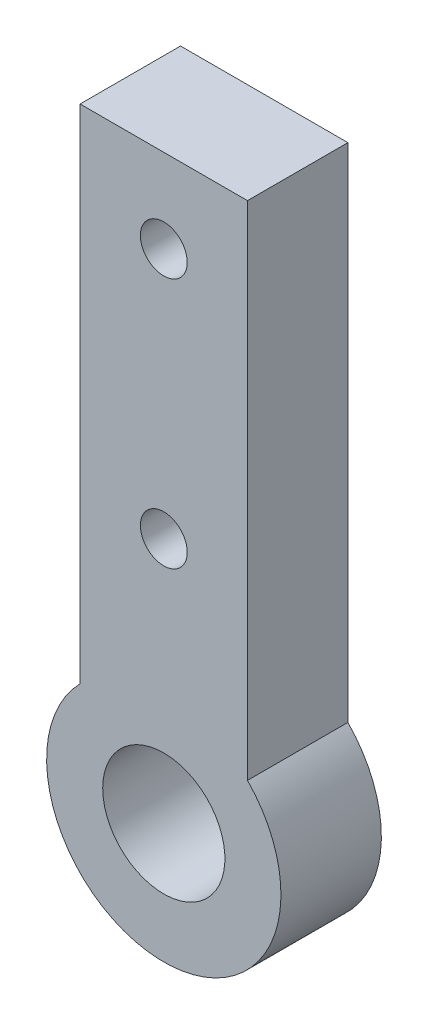
ISO-10303-21;
HEADER;
FILE_DESCRIPTION(('STEP AP214'),'2;1');
FILE_NAME('part.step','',(''),(''),'','','');
FILE_SCHEMA(('AUTOMOTIVE_DESIGN { 1 0 10303 214 1 1 1 1 }'));
ENDSEC;
DATA;
#1=APPLICATION_CONTEXT('core data for automotive mechanical design processes');
#2=APPLICATION_PROTOCOL_DEFINITION('international standard','automotive_design',2000,#1);
#3=PRODUCT_CONTEXT('',#1,'mechanical');
#4=PRODUCT('Part','Part','',(#3));
#5=PRODUCT_RELATED_PRODUCT_CATEGORY('part','',(#4));
#6=PRODUCT_DEFINITION_FORMATION('','',#4);
#7=PRODUCT_DEFINITION_CONTEXT('part definition',#1,'design');
#8=PRODUCT_DEFINITION('design','',#6,#7);
#9=PRODUCT_DEFINITION_SHAPE('','',#8);
#10=(LENGTH_UNIT() NAMED_UNIT(*) SI_UNIT(.MILLI.,.METRE.));
#11=(NAMED_UNIT(*) PLANE_ANGLE_UNIT() SI_UNIT($,.RADIAN.));
#12=(NAMED_UNIT(*) SI_UNIT($,.STERADIAN.) SOLID_ANGLE_UNIT());
#13=UNCERTAINTY_MEASURE_WITH_UNIT(LENGTH_MEASURE(1.E-05),#10,'distance_accuracy_value','');
#14=(GEOMETRIC_REPRESENTATION_CONTEXT(3) GLOBAL_UNCERTAINTY_ASSIGNED_CONTEXT((#13)) GLOBAL_UNIT_ASSIGNED_CONTEXT((#10,
#11,#12)) REPRESENTATION_CONTEXT('',''));
#15=CARTESIAN_POINT('',(0.,0.,0.));
#16=DIRECTION('',(0.,0.,1.));
#17=DIRECTION('',(1.,0.,0.));
#18=AXIS2_PLACEMENT_3D('',#15,#16,#17);
#19=CARTESIAN_POINT('',(-5.00000000000001,18.9279166419525,6.));
#20=DIRECTION('',(1.,0.,0.));
#21=DIRECTION('',(0.,1.,0.));
#22=AXIS2_PLACEMENT_3D('',#19,#20,#21);
#23=PLANE('',#22);
#24=DIRECTION('',(0.,-1.,0.));
#25=VECTOR('',#24,1.);
#26=CARTESIAN_POINT('',(-5.00000000000001,18.9279166419525,0.));
#27=LINE('',#26,#25);
#28=CARTESIAN_POINT('',(-5.00000000000001,18.9279166419525,0.));
#29=VERTEX_POINT('',#28);
#30=CARTESIAN_POINT('',(-5.00000000000001,-11.0720833580475,0.));
#31=VERTEX_POINT('',#30);
#32=EDGE_CURVE('E98',#29,#31,#27,.T.);
#33=ORIENTED_EDGE('',*,*,#32,.T.);
#34=DIRECTION('',(0.,0.,-1.));
#35=VECTOR('',#34,1.);
#36=CARTESIAN_POINT('',(-5.00000000000001,-11.0720833580475,6.));
#37=LINE('',#36,#35);
#38=CARTESIAN_POINT('',(-5.00000000000001,-11.0720833580475,6.));
#39=VERTEX_POINT('',#38);
#40=EDGE_CURVE('E11',#39,#31,#37,.T.);
#41=ORIENTED_EDGE('',*,*,#40,.F.);
#42=DIRECTION('',(0.,-1.,0.));
#43=VECTOR('',#42,1.);
#44=CARTESIAN_POINT('',(-5.00000000000001,18.9279166419525,6.));
#45=LINE('',#44,#43);
#46=CARTESIAN_POINT('',(-5.00000000000001,18.9279166419525,6.));
#47=VERTEX_POINT('',#46);
#48=EDGE_CURVE('E86',#47,#39,#45,.T.);
#49=ORIENTED_EDGE('',*,*,#48,.F.);
#50=DIRECTION('',(0.,0.,-1.));
#51=VECTOR('',#50,1.);
#52=CARTESIAN_POINT('',(-5.00000000000001,18.9279166419525,6.));
#53=LINE('',#52,#51);
#54=EDGE_CURVE('E94',#47,#29,#53,.T.);
#55=ORIENTED_EDGE('',*,*,#54,.T.);
#56=EDGE_LOOP('',(#33,#41,#49,#55));
#57=FACE_BOUND('',#56,.T.);
#58=ADVANCED_FACE('F35',(#57),#23,.F.);
#59=CARTESIAN_POINT('',(0.,-15.9710628436139,6.));
#60=DIRECTION('',(0.,0.,-1.));
#61=DIRECTION('',(-1.,0.,0.));
#62=AXIS2_PLACEMENT_3D('',#59,#60,#61);
#63=CYLINDRICAL_SURFACE('',#62,7.);
#64=CARTESIAN_POINT('',(0.,-15.9710628436139,0.));
#65=DIRECTION('',(0.,0.,1.));
#66=DIRECTION('',(-1.,0.,0.));
#67=AXIS2_PLACEMENT_3D('',#64,#65,#66);
#68=CIRCLE('',#67,7.);
#69=CARTESIAN_POINT('',(5.,-11.0720833580475,0.));
#70=VERTEX_POINT('',#69);
#71=EDGE_CURVE('E90',#31,#70,#68,.T.);
#72=ORIENTED_EDGE('',*,*,#71,.T.);
#73=DIRECTION('',(0.,0.,-1.));
#74=VECTOR('',#73,1.);
#75=CARTESIAN_POINT('',(5.,-11.0720833580475,6.));
#76=LINE('',#75,#74);
#77=CARTESIAN_POINT('',(5.,-11.0720833580475,6.));
#78=VERTEX_POINT('',#77);
#79=EDGE_CURVE('E43',#78,#70,#76,.T.);
#80=ORIENTED_EDGE('',*,*,#79,.F.);
#81=CARTESIAN_POINT('',(0.,-15.9710628436139,6.));
#82=DIRECTION('',(0.,0.,1.));
#83=DIRECTION('',(-1.,0.,0.));
#84=AXIS2_PLACEMENT_3D('',#81,#82,#83);
#85=CIRCLE('',#84,7.);
#86=EDGE_CURVE('E81',#39,#78,#85,.T.);
#87=ORIENTED_EDGE('',*,*,#86,.F.);
#88=ORIENTED_EDGE('',*,*,#40,.T.);
#89=EDGE_LOOP('',(#72,#80,#87,#88));
#90=FACE_BOUND('',#89,.T.);
#91=ADVANCED_FACE('F89',(#90),#63,.T.);
#92=CARTESIAN_POINT('',(4.99999999999999,18.9279166419525,6.));
#93=DIRECTION('',(-1.,0.,0.));
#94=DIRECTION('',(0.,-1.,0.));
#95=AXIS2_PLACEMENT_3D('',#92,#93,#94);
#96=PLANE('',#95);
#97=DIRECTION('',(0.,1.,0.));
#98=VECTOR('',#97,1.);
#99=CARTESIAN_POINT('',(4.99999999999999,18.9279166419525,0.));
#100=LINE('',#99,#98);
#101=CARTESIAN_POINT('',(4.99999999999999,18.9279166419525,0.));
#102=VERTEX_POINT('',#101);
#103=EDGE_CURVE('E68',#70,#102,#100,.T.);
#104=ORIENTED_EDGE('',*,*,#103,.T.);
#105=DIRECTION('',(0.,0.,-1.));
#106=VECTOR('',#105,1.);
#107=CARTESIAN_POINT('',(4.99999999999999,18.9279166419525,6.));
#108=LINE('',#107,#106);
#109=CARTESIAN_POINT('',(4.99999999999999,18.9279166419525,6.));
#110=VERTEX_POINT('',#109);
#111=EDGE_CURVE('E91',#110,#102,#108,.T.);
#112=ORIENTED_EDGE('',*,*,#111,.F.);
#113=DIRECTION('',(0.,1.,0.));
#114=VECTOR('',#113,1.);
#115=CARTESIAN_POINT('',(4.99999999999999,18.9279166419525,6.));
#116=LINE('',#115,#114);
#117=EDGE_CURVE('E84',#78,#110,#116,.T.);
#118=ORIENTED_EDGE('',*,*,#117,.F.);
#119=ORIENTED_EDGE('',*,*,#79,.T.);
#120=EDGE_LOOP('',(#104,#112,#118,#119));
#121=FACE_BOUND('',#120,.T.);
#122=ADVANCED_FACE('F92',(#121),#96,.F.);
#123=CARTESIAN_POINT('',(-5.00000000000001,18.9279166419525,6.));
#124=DIRECTION('',(0.,-1.,0.));
#125=DIRECTION('',(0.,0.,-1.));
#126=AXIS2_PLACEMENT_3D('',#123,#124,#125);
#127=PLANE('',#126);
#128=DIRECTION('',(-1.,0.,0.));
#129=VECTOR('',#128,1.);
#130=CARTESIAN_POINT('',(-5.00000000000001,18.9279166419525,0.));
#131=LINE('',#130,#129);
#132=EDGE_CURVE('E74',#102,#29,#131,.T.);
#133=ORIENTED_EDGE('',*,*,#132,.T.);
#134=ORIENTED_EDGE('',*,*,#54,.F.);
#135=DIRECTION('',(-1.,0.,0.));
#136=VECTOR('',#135,1.);
#137=CARTESIAN_POINT('',(-5.00000000000001,18.9279166419525,6.));
#138=LINE('',#137,#136);
#139=EDGE_CURVE('E51',#110,#47,#138,.T.);
#140=ORIENTED_EDGE('',*,*,#139,.F.);
#141=ORIENTED_EDGE('',*,*,#111,.T.);
#142=EDGE_LOOP('',(#133,#134,#140,#141));
#143=FACE_BOUND('',#142,.T.);
#144=ADVANCED_FACE('F106',(#143),#127,.F.);
#145=CARTESIAN_POINT('',(0.,-15.9710628436139,6.));
#146=DIRECTION('',(0.,0.,-1.));
#147=DIRECTION('',(-1.,0.,0.));
#148=AXIS2_PLACEMENT_3D('',#145,#146,#147);
#149=PLANE('',#148);
#150=CARTESIAN_POINT('',(0.,13.9279166419525,6.));
#151=DIRECTION('',(0.,0.,-1.));
#152=DIRECTION('',(-1.,0.,0.));
#153=AXIS2_PLACEMENT_3D('',#150,#151,#152);
#154=CIRCLE('',#153,1.4);
#155=CARTESIAN_POINT('',(-1.4,13.9279166419525,6.));
#156=VERTEX_POINT('',#155);
#157=EDGE_CURVE('E121',#156,#156,#154,.T.);
#158=ORIENTED_EDGE('',*,*,#157,.T.);
#159=EDGE_LOOP('',(#158));
#160=FACE_BOUND('',#159,.T.);
#161=CARTESIAN_POINT('',(0.,-1.07208335804753,6.));
#162=DIRECTION('',(0.,0.,-1.));
#163=DIRECTION('',(-1.,0.,0.));
#164=AXIS2_PLACEMENT_3D('',#161,#162,#163);
#165=CIRCLE('',#164,1.4);
#166=CARTESIAN_POINT('',(-1.4,-1.07208335804753,6.));
#167=VERTEX_POINT('',#166);
#168=EDGE_CURVE('E115',#167,#167,#165,.T.);
#169=ORIENTED_EDGE('',*,*,#168,.T.);
#170=EDGE_LOOP('',(#169));
#171=FACE_BOUND('',#170,.T.);
#172=CARTESIAN_POINT('',(0.,-15.7995866539924,6.));
#173=DIRECTION('',(0.,0.,-1.));
#174=DIRECTION('',(-1.,0.,0.));
#175=AXIS2_PLACEMENT_3D('',#172,#173,#174);
#176=CIRCLE('',#175,3.65);
#177=CARTESIAN_POINT('',(-3.65,-15.7995866539924,6.));
#178=VERTEX_POINT('',#177);
#179=EDGE_CURVE('E101',#178,#178,#176,.T.);
#180=ORIENTED_EDGE('',*,*,#179,.T.);
#181=EDGE_LOOP('',(#180));
#182=FACE_BOUND('',#181,.T.);
#183=ORIENTED_EDGE('',*,*,#48,.T.);
#184=ORIENTED_EDGE('',*,*,#86,.T.);
#185=ORIENTED_EDGE('',*,*,#117,.T.);
#186=ORIENTED_EDGE('',*,*,#139,.T.);
#187=EDGE_LOOP('',(#183,#184,#185,#186));
#188=FACE_BOUND('',#187,.T.);
#189=ADVANCED_FACE('F82',(#160,#171,#182,#188),#149,.F.);
#190=CARTESIAN_POINT('',(0.,-15.9710628436139,0.));
#191=DIRECTION('',(0.,0.,-1.));
#192=DIRECTION('',(-1.,0.,0.));
#193=AXIS2_PLACEMENT_3D('',#190,#191,#192);
#194=PLANE('',#193);
#195=CARTESIAN_POINT('',(0.,13.9279166419525,0.));
#196=DIRECTION('',(0.,0.,-1.));
#197=DIRECTION('',(-1.,0.,0.));
#198=AXIS2_PLACEMENT_3D('',#195,#196,#197);
#199=CIRCLE('',#198,1.4);
#200=CARTESIAN_POINT('',(-1.4,13.9279166419525,0.));
#201=VERTEX_POINT('',#200);
#202=EDGE_CURVE('E124',#201,#201,#199,.T.);
#203=ORIENTED_EDGE('',*,*,#202,.F.);
#204=EDGE_LOOP('',(#203));
#205=FACE_BOUND('',#204,.T.);
#206=CARTESIAN_POINT('',(0.,-1.07208335804753,0.));
#207=DIRECTION('',(0.,0.,-1.));
#208=DIRECTION('',(-1.,0.,0.));
#209=AXIS2_PLACEMENT_3D('',#206,#207,#208);
#210=CIRCLE('',#209,1.4);
#211=CARTESIAN_POINT('',(-1.4,-1.07208335804753,0.));
#212=VERTEX_POINT('',#211);
#213=EDGE_CURVE('E118',#212,#212,#210,.T.);
#214=ORIENTED_EDGE('',*,*,#213,.F.);
#215=EDGE_LOOP('',(#214));
#216=FACE_BOUND('',#215,.T.);
#217=CARTESIAN_POINT('',(0.,-15.7995866539924,0.));
#218=DIRECTION('',(0.,0.,-1.));
#219=DIRECTION('',(-1.,0.,0.));
#220=AXIS2_PLACEMENT_3D('',#217,#218,#219);
#221=CIRCLE('',#220,3.65);
#222=CARTESIAN_POINT('',(-3.65,-15.7995866539924,0.));
#223=VERTEX_POINT('',#222);
#224=EDGE_CURVE('E112',#223,#223,#221,.T.);
#225=ORIENTED_EDGE('',*,*,#224,.F.);
#226=EDGE_LOOP('',(#225));
#227=FACE_BOUND('',#226,.T.);
#228=ORIENTED_EDGE('',*,*,#32,.F.);
#229=ORIENTED_EDGE('',*,*,#132,.F.);
#230=ORIENTED_EDGE('',*,*,#103,.F.);
#231=ORIENTED_EDGE('',*,*,#71,.F.);
#232=EDGE_LOOP('',(#228,#229,#230,#231));
#233=FACE_BOUND('',#232,.T.);
#234=ADVANCED_FACE('F109',(#205,#216,#227,#233),#194,.T.);
#235=CARTESIAN_POINT('',(0.,-15.7995866539924,6.));
#236=DIRECTION('',(0.,0.,-1.));
#237=DIRECTION('',(-1.,0.,0.));
#238=AXIS2_PLACEMENT_3D('',#235,#236,#237);
#239=CYLINDRICAL_SURFACE('',#238,3.65);
#240=ORIENTED_EDGE('',*,*,#179,.F.);
#241=EDGE_LOOP('',(#240));
#242=FACE_BOUND('',#241,.T.);
#243=ORIENTED_EDGE('',*,*,#224,.T.);
#244=EDGE_LOOP('',(#243));
#245=FACE_BOUND('',#244,.T.);
#246=ADVANCED_FACE('F141',(#242,#245),#239,.F.);
#247=CARTESIAN_POINT('',(0.,-1.07208335804753,6.));
#248=DIRECTION('',(0.,0.,-1.));
#249=DIRECTION('',(-1.,0.,0.));
#250=AXIS2_PLACEMENT_3D('',#247,#248,#249);
#251=CYLINDRICAL_SURFACE('',#250,1.4);
#252=ORIENTED_EDGE('',*,*,#168,.F.);
#253=EDGE_LOOP('',(#252));
#254=FACE_BOUND('',#253,.T.);
#255=ORIENTED_EDGE('',*,*,#213,.T.);
#256=EDGE_LOOP('',(#255));
#257=FACE_BOUND('',#256,.T.);
#258=ADVANCED_FACE('F135',(#254,#257),#251,.F.);
#259=CARTESIAN_POINT('',(0.,13.9279166419525,6.));
#260=DIRECTION('',(0.,0.,-1.));
#261=DIRECTION('',(-1.,0.,0.));
#262=AXIS2_PLACEMENT_3D('',#259,#260,#261);
#263=CYLINDRICAL_SURFACE('',#262,1.4);
#264=ORIENTED_EDGE('',*,*,#157,.F.);
#265=EDGE_LOOP('',(#264));
#266=FACE_BOUND('',#265,.T.);
#267=ORIENTED_EDGE('',*,*,#202,.T.);
#268=EDGE_LOOP('',(#267));
#269=FACE_BOUND('',#268,.T.);
#270=ADVANCED_FACE('F132',(#266,#269),#263,.F.);
#271=CLOSED_SHELL('',(#58,#91,#122,#144,#189,#234,#246,#258,#270));
#272=MANIFOLD_SOLID_BREP('B2',#271);
#273=ADVANCED_BREP_SHAPE_REPRESENTATION('',(#18,#272),#14);
#274=SHAPE_DEFINITION_REPRESENTATION(#9,#273);
ENDSEC;
END-ISO-10303-21;
